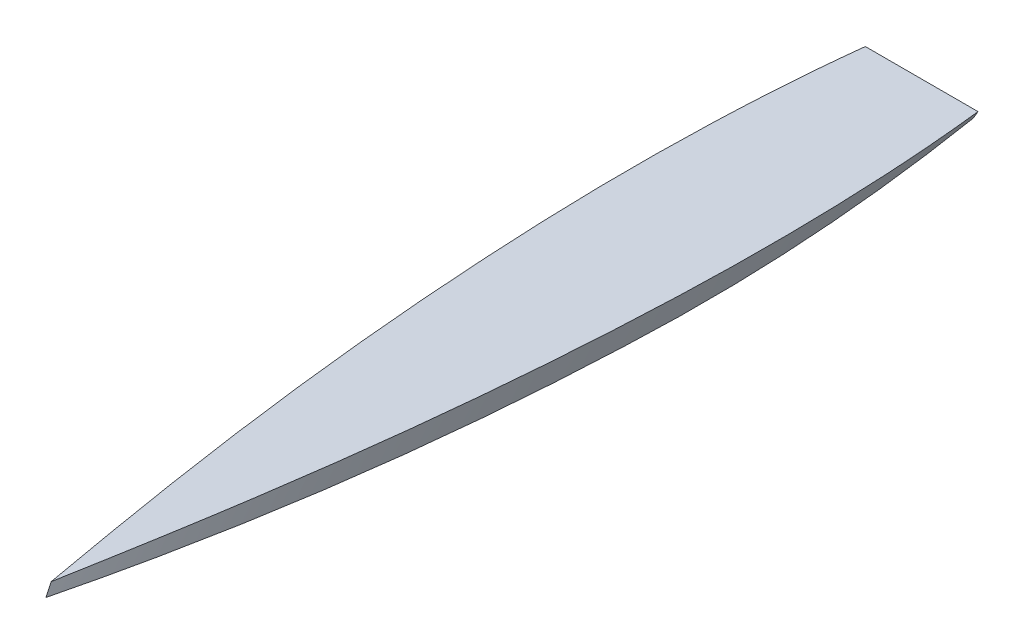
ISO-10303-21;
HEADER;
FILE_DESCRIPTION(('STEP AP214'),'2;1');
FILE_NAME('part.step','',(''),(''),'','','');
FILE_SCHEMA(('AUTOMOTIVE_DESIGN { 1 0 10303 214 1 1 1 1 }'));
ENDSEC;
DATA;
#1=APPLICATION_CONTEXT('core data for automotive mechanical design processes');
#2=APPLICATION_PROTOCOL_DEFINITION('international standard','automotive_design',2000,#1);
#3=PRODUCT_CONTEXT('',#1,'mechanical');
#4=PRODUCT('Part','Part','',(#3));
#5=PRODUCT_RELATED_PRODUCT_CATEGORY('part','',(#4));
#6=PRODUCT_DEFINITION_FORMATION('','',#4);
#7=PRODUCT_DEFINITION_CONTEXT('part definition',#1,'design');
#8=PRODUCT_DEFINITION('design','',#6,#7);
#9=PRODUCT_DEFINITION_SHAPE('','',#8);
#10=(LENGTH_UNIT() NAMED_UNIT(*) SI_UNIT(.MILLI.,.METRE.));
#11=(NAMED_UNIT(*) PLANE_ANGLE_UNIT() SI_UNIT($,.RADIAN.));
#12=(NAMED_UNIT(*) SI_UNIT($,.STERADIAN.) SOLID_ANGLE_UNIT());
#13=UNCERTAINTY_MEASURE_WITH_UNIT(LENGTH_MEASURE(1.E-05),#10,'distance_accuracy_value','');
#14=(GEOMETRIC_REPRESENTATION_CONTEXT(3) GLOBAL_UNCERTAINTY_ASSIGNED_CONTEXT((#13)) GLOBAL_UNIT_ASSIGNED_CONTEXT((#10,
#11,#12)) REPRESENTATION_CONTEXT('',''));
#15=CARTESIAN_POINT('',(0.,0.,0.));
#16=DIRECTION('',(0.,0.,1.));
#17=DIRECTION('',(1.,0.,0.));
#18=AXIS2_PLACEMENT_3D('',#15,#16,#17);
#19=CARTESIAN_POINT('',(0.,50.,0.));
#20=DIRECTION('',(0.,1.,0.));
#21=DIRECTION('',(0.,0.,1.));
#22=AXIS2_PLACEMENT_3D('',#19,#20,#21);
#23=PLANE('',#22);
#24=DIRECTION('',(-1.,0.,0.));
#25=VECTOR('',#24,1.);
#26=CARTESIAN_POINT('',(0.,50.,-5500.));
#27=LINE('',#26,#25);
#28=CARTESIAN_POINT('',(353.846153846155,50.,-5500.));
#29=VERTEX_POINT('',#28);
#30=CARTESIAN_POINT('',(-353.846153846155,50.,-5500.));
#31=VERTEX_POINT('',#30);
#32=EDGE_CURVE('E127',#29,#31,#27,.T.);
#33=ORIENTED_EDGE('',*,*,#32,.T.);
#34=CARTESIAN_POINT('',(-353.846153846155,50.,-5500.));
#35=CARTESIAN_POINT('',(-355.494475382305,50.,-5485.73603092094));
#36=CARTESIAN_POINT('',(-357.107757859096,50.,-5471.46802501439));
#37=CARTESIAN_POINT('',(-360.266483073462,50.,-5442.92458720515));
#38=CARTESIAN_POINT('',(-361.811926201855,50.,-5428.64915534572));
#39=CARTESIAN_POINT('',(-364.837227775977,50.,-5400.09137029185));
#40=CARTESIAN_POINT('',(-366.317086319926,50.,-5385.80901710781));
#41=CARTESIAN_POINT('',(-369.212949780399,50.,-5357.24028510158));
#42=CARTESIAN_POINT('',(-370.628965469393,50.,-5342.95390737094));
#43=CARTESIAN_POINT('',(-373.399216294718,50.,-5314.37514511127));
#44=CARTESIAN_POINT('',(-374.753451341881,50.,-5300.08276057361));
#45=CARTESIAN_POINT('',(-377.401774264953,50.,-5271.492416347));
#46=CARTESIAN_POINT('',(-378.695862116136,50.,-5257.19445665575));
#47=CARTESIAN_POINT('',(-381.22527594233,50.,-5228.59452597008));
#48=CARTESIAN_POINT('',(-382.460606734643,50.,-5214.29255540154));
#49=CARTESIAN_POINT('',(-384.8739777462,50.,-5185.6837916399));
#50=CARTESIAN_POINT('',(-386.052017999292,50.,-5171.37699844966));
#51=CARTESIAN_POINT('',(-388.352050559336,50.,-5142.75891118696));
#52=CARTESIAN_POINT('',(-389.47404287446,50.,-5128.44761711514));
#53=CARTESIAN_POINT('',(-391.663085977972,50.,-5099.82123850941));
#54=CARTESIAN_POINT('',(-392.730138328043,50.,-5085.50615409488));
#55=CARTESIAN_POINT('',(-394.810380105171,50.,-5056.87207269894));
#56=CARTESIAN_POINT('',(-395.823569529367,50.,-5042.55307571732));
#57=CARTESIAN_POINT('',(-397.797042803667,50.,-5013.91143728101));
#58=CARTESIAN_POINT('',(-398.75732665283,50.,-4999.58879582625));
#59=CARTESIAN_POINT('',(-400.625883192003,50.,-4970.94011030944));
#60=CARTESIAN_POINT('',(-401.534155840159,50.,-4956.61406624466));
#61=CARTESIAN_POINT('',(-403.29952890201,50.,-4927.95882701317));
#62=CARTESIAN_POINT('',(-404.156629320536,50.,-4913.62963184676));
#63=CARTESIAN_POINT('',(-405.820431233438,50.,-4884.96832027813));
#64=CARTESIAN_POINT('',(-406.627132729131,50.,-4870.63620387598));
#65=CARTESIAN_POINT('',(-408.580700480576,50.,-4834.82252992145));
#66=CARTESIAN_POINT('',(-409.696623728737,50.,-4813.33927760853));
#67=CARTESIAN_POINT('',(-411.819120026891,50.,-4770.36738321299));
#68=CARTESIAN_POINT('',(-412.825693076396,50.,-4748.87874113035));
#69=CARTESIAN_POINT('',(-414.731501431729,50.,-4705.89602867817));
#70=CARTESIAN_POINT('',(-415.630733397584,50.,-4684.40195816058));
#71=CARTESIAN_POINT('',(-417.323613255518,50.,-4641.40966442522));
#72=CARTESIAN_POINT('',(-418.11726114912,50.,-4619.91144120752));
#73=CARTESIAN_POINT('',(-419.600614534489,50.,-4576.91087695005));
#74=CARTESIAN_POINT('',(-420.290317464621,50.,-4555.40853582187));
#75=CARTESIAN_POINT('',(-421.567224186407,50.,-4512.40080235399));
#76=CARTESIAN_POINT('',(-422.154427854779,50.,-4490.89541001066));
#77=CARTESIAN_POINT('',(-423.764363073529,50.,-4426.3750528871));
#78=CARTESIAN_POINT('',(-424.635408146755,50.,-4383.3562191135));
#79=CARTESIAN_POINT('',(-425.982603893335,50.,-4297.31286031856));
#80=CARTESIAN_POINT('',(-426.458758836103,50.,-4254.28833536378));
#81=CARTESIAN_POINT('',(-426.859267068212,50.,-4193.34854783468));
#82=CARTESIAN_POINT('',(-426.943478523649,50.,-4175.43421911285));
#83=CARTESIAN_POINT('',(-427.045374851772,50.,-4139.60534754906));
#84=CARTESIAN_POINT('',(-427.063059677615,50.,-4121.69080470695));
#85=CARTESIAN_POINT('',(-427.032408198666,50.,-4085.86177637969));
#86=CARTESIAN_POINT('',(-426.984071882108,50.,-4067.94729089454));
#87=CARTESIAN_POINT('',(-426.82185379543,50.,-4032.11902424088));
#88=CARTESIAN_POINT('',(-426.707973517774,50.,-4014.20524306563));
#89=CARTESIAN_POINT('',(-426.415126833831,50.,-3978.3782174236));
#90=CARTESIAN_POINT('',(-426.236160441798,50.,-3960.46497295671));
#91=CARTESIAN_POINT('',(-425.813593250575,50.,-3924.63924817297));
#92=CARTESIAN_POINT('',(-425.569992455856,50.,-3906.72676785607));
#93=CARTESIAN_POINT('',(-425.018588001412,50.,-3870.90291976826));
#94=CARTESIAN_POINT('',(-424.710784786479,50.,-3852.9915519905));
#95=CARTESIAN_POINT('',(-424.031387508986,50.,-3817.17002671723));
#96=CARTESIAN_POINT('',(-423.659793442158,50.,-3799.2598692218));
#97=CARTESIAN_POINT('',(-422.853212017789,50.,-3763.44097569306));
#98=CARTESIAN_POINT('',(-422.418224652302,50.,-3745.53223965994));
#99=CARTESIAN_POINT('',(-421.718486621486,50.,-3718.67035588195));
#100=CARTESIAN_POINT('',(-421.477364107681,50.,-3709.71658651115));
#101=CARTESIAN_POINT('',(-420.979413568863,50.,-3691.80948361767));
#102=CARTESIAN_POINT('',(-420.722585544148,50.,-3682.85615009498));
#103=CARTESIAN_POINT('',(-420.193270436888,50.,-3664.94994856931));
#104=CARTESIAN_POINT('',(-419.920783358452,50.,-3655.99708056621));
#105=CARTESIAN_POINT('',(-419.360195762576,50.,-3638.0918330399));
#106=CARTESIAN_POINT('',(-419.072095244367,50.,-3629.13945351673));
#107=CARTESIAN_POINT('',(-418.480326153211,50.,-3611.23521558348));
#108=CARTESIAN_POINT('',(-418.17665759248,50.,-3602.283357173));
#109=CARTESIAN_POINT('',(-417.709512102259,50.,-3588.85597616638));
#110=CARTESIAN_POINT('',(-417.551856498889,50.,-3584.38025030835));
#111=CARTESIAN_POINT('',(-417.232669916953,50.,-3575.42893658339));
#112=CARTESIAN_POINT('',(-417.071138938331,50.,-3570.95334871646));
#113=CARTESIAN_POINT('',(-416.744170092243,50.,-3562.00130032576));
#114=CARTESIAN_POINT('',(-416.578731347854,50.,-3557.52483983402));
#115=CARTESIAN_POINT('',(-416.243987736396,50.,-3548.57206347246));
#116=CARTESIAN_POINT('',(-416.074682869449,50.,-3544.09574760265));
#117=CARTESIAN_POINT('',(-415.817830094529,50.,-3537.38138446422));
#118=CARTESIAN_POINT('',(-415.731729918329,50.,-3535.14328172243));
#119=CARTESIAN_POINT('',(-415.558565050202,50.,-3530.6671135586));
#120=CARTESIAN_POINT('',(-415.471500358285,50.,-3528.42904813655));
#121=CARTESIAN_POINT('',(-415.296407297503,50.,-3523.95295491675));
#122=CARTESIAN_POINT('',(-415.20837892861,50.,-3521.71492711901));
#123=CARTESIAN_POINT('',(-415.031358587484,50.,-3517.23890963845));
#124=CARTESIAN_POINT('',(-414.942366615242,50.,-3515.00091995564));
#125=CARTESIAN_POINT('',(-414.674294705667,50.,-3508.28699106837));
#126=CARTESIAN_POINT('',(-414.494118914982,50.,-3503.81109557687));
#127=CARTESIAN_POINT('',(-414.13074288371,50.,-3494.85942743317));
#128=CARTESIAN_POINT('',(-413.947542643154,50.,-3490.38365478097));
#129=CARTESIAN_POINT('',(-413.578147052476,50.,-3481.43223306354));
#130=CARTESIAN_POINT('',(-413.391951702361,50.,-3476.95658399831));
#131=CARTESIAN_POINT('',(-413.016560076104,50.,-3468.00541181381));
#132=CARTESIAN_POINT('',(-412.827363799973,50.,-3463.52988869453));
#133=CARTESIAN_POINT('',(-412.255278479207,50.,-3450.1035060567));
#134=CARTESIAN_POINT('',(-411.867893124765,50.,-3441.15283768219));
#135=CARTESIAN_POINT('',(-411.081143841873,50.,-3423.25202807181));
#136=CARTESIAN_POINT('',(-410.681779913841,50.,-3414.30188683593));
#137=CARTESIAN_POINT('',(-409.871082348101,50.,-3396.40204305069));
#138=CARTESIAN_POINT('',(-409.459748572722,50.,-3387.45234050757));
#139=CARTESIAN_POINT('',(-408.625129097153,50.,-3369.55349320536));
#140=CARTESIAN_POINT('',(-408.201843396731,50.,-3360.60434844627));
#141=CARTESIAN_POINT('',(-406.914079916323,50.,-3333.75779463843));
#142=CARTESIAN_POINT('',(-406.031694628215,50.,-3315.86124113337));
#143=CARTESIAN_POINT('',(-404.219284299551,50.,-3280.07055543011));
#144=CARTESIAN_POINT('',(-403.289259275703,50.,-3262.17642323108));
#145=CARTESIAN_POINT('',(-401.381679734732,50.,-3226.3905662266));
#146=CARTESIAN_POINT('',(-400.404124884909,50.,-3208.49884143889));
#147=CARTESIAN_POINT('',(-398.401613140832,50.,-3172.7180359244));
#148=CARTESIAN_POINT('',(-397.376656222463,50.,-3154.82895519898));
#149=CARTESIAN_POINT('',(-395.2794671867,50.,-3119.05356026288));
#150=CARTESIAN_POINT('',(-394.207235056511,50.,-3101.16724605294));
#151=CARTESIAN_POINT('',(-392.015628086499,50.,-3065.39751690924));
#152=CARTESIAN_POINT('',(-390.896253274773,50.,-3047.51410197376));
#153=CARTESIAN_POINT('',(-388.610498744776,50.,-3011.75028207262));
#154=CARTESIAN_POINT('',(-387.444119041541,50.,-2993.869877106));
#155=CARTESIAN_POINT('',(-385.064498611438,50.,-2958.11219696002));
#156=CARTESIAN_POINT('',(-383.851257912769,50.,-2940.23492177879));
#157=CARTESIAN_POINT('',(-381.378724681719,50.,-2904.49315773869));
#158=CARTESIAN_POINT('',(-380.119457114337,50.,-2886.62866715338));
#159=CARTESIAN_POINT('',(-377.554414806447,50.,-2850.90303571255));
#160=CARTESIAN_POINT('',(-376.248640081118,50.,-2833.04189485594));
#161=CARTESIAN_POINT('',(-372.261818953333,50.,-2779.46399599387));
#162=CARTESIAN_POINT('',(-369.511249584799,50.,-2743.75238573784));
#163=CARTESIAN_POINT('',(-363.826096793675,50.,-2672.34405923576));
#164=CARTESIAN_POINT('',(-360.891514511293,50.,-2636.6473428988));
#165=CARTESIAN_POINT('',(-354.839803984173,50.,-2565.26949686994));
#166=CARTESIAN_POINT('',(-351.722676309203,50.,-2529.58836712973));
#167=CARTESIAN_POINT('',(-345.307472584919,50.,-2458.24240631439));
#168=CARTESIAN_POINT('',(-342.009396657844,50.,-2422.57757522826));
#169=CARTESIAN_POINT('',(-335.23403219837,50.,-2351.26490390888));
#170=CARTESIAN_POINT('',(-331.75674347394,50.,-2315.61706369387));
#171=CARTESIAN_POINT('',(-324.625087785852,50.,-2244.34161325011));
#172=CARTESIAN_POINT('',(-320.970733180418,50.,-2208.71400178458));
#173=CARTESIAN_POINT('',(-313.486798661448,50.,-2137.47706863252));
#174=CARTESIAN_POINT('',(-309.657218152377,50.,-2101.86774700856));
#175=CARTESIAN_POINT('',(-301.825183292883,50.,-2030.66804854774));
#176=CARTESIAN_POINT('',(-297.822728581522,50.,-1995.07767175058));
#177=CARTESIAN_POINT('',(-289.647489459514,50.,-1923.9164964078));
#178=CARTESIAN_POINT('',(-285.474705075196,50.,-1888.34569785914));
#179=CARTESIAN_POINT('',(-276.961580459458,50.,-1817.22428323685));
#180=CARTESIAN_POINT('',(-272.621240802911,50.0000000000001,-1781.67366709441));
#181=CARTESIAN_POINT('',(-263.776047596488,49.9999999999999,-1710.59320217858));
#182=CARTESIAN_POINT('',(-259.271195339251,49.9999999999995,-1675.06335324426));
#183=CARTESIAN_POINT('',(-248.89835181705,49.9999999999994,-1594.71450807813));
#184=CARTESIAN_POINT('',(-242.98255727467,49.9999999999998,-1549.90167682818));
#185=CARTESIAN_POINT('',(-230.901479743162,50.0000000000002,-1460.30976567275));
#186=CARTESIAN_POINT('',(-224.736197200323,50.,-1415.53068570704));
#187=CARTESIAN_POINT('',(-212.164374155111,50.,-1326.00607215459));
#188=CARTESIAN_POINT('',(-205.757831833955,50.,-1281.26053882335));
#189=CARTESIAN_POINT('',(-192.712661906579,50.,-1191.80270444251));
#190=CARTESIAN_POINT('',(-186.074031079608,50.,-1147.09040386289));
#191=CARTESIAN_POINT('',(-172.575076714923,50.,-1057.69851008236));
#192=CARTESIAN_POINT('',(-165.714749442695,50.,-1013.01891744539));
#193=CARTESIAN_POINT('',(-155.266999661235,50.,-946.023738163458));
#194=CARTESIAN_POINT('',(-151.75817677275,50.,-923.695861212409));
#195=CARTESIAN_POINT('',(-144.689799715734,50.,-879.048134614898));
#196=CARTESIAN_POINT('',(-141.130245547227,50.,-856.728284968432));
#197=CARTESIAN_POINT('',(-133.962405660808,50.,-812.097678217767));
#198=CARTESIAN_POINT('',(-130.354122642851,50.,-789.786920679788));
#199=CARTESIAN_POINT('',(-123.090564467909,50.,-745.173050726721));
#200=CARTESIAN_POINT('',(-119.43528929723,50.,-722.869938313863));
#201=CARTESIAN_POINT('',(-112.079823103553,50.,-678.271153211678));
#202=CARTESIAN_POINT('',(-108.379632140153,50.,-655.975480512519));
#203=CARTESIAN_POINT('',(-100.936552111352,50.,-611.391269461622));
#204=CARTESIAN_POINT('',(-97.1936630546512,50.,-589.102731108433));
#205=CARTESIAN_POINT('',(-89.6676243903792,50.,-544.532765368542));
#206=CARTESIAN_POINT('',(-85.8844753299114,50.,-522.251337889438));
#207=CARTESIAN_POINT('',(-78.2804330187357,50.,-477.694925681615));
#208=CARTESIAN_POINT('',(-74.4595397676119,50.,-455.419940952967));
#209=CARTESIAN_POINT('',(-66.7828983517902,50.,-410.876684327875));
#210=CARTESIAN_POINT('',(-62.9271512611775,50.,-388.608412246274));
#211=CARTESIAN_POINT('',(-55.1836786382871,50.,-344.077428620562));
#212=CARTESIAN_POINT('',(-51.2959531036225,50.,-321.814717076868));
#213=CARTESIAN_POINT('',(-43.4919572523499,50.,-277.295507467986));
#214=CARTESIAN_POINT('',(-39.5756884496975,50.,-255.039009137332));
#215=CARTESIAN_POINT('',(-31.7178917571624,50.,-210.530470345935));
#216=CARTESIAN_POINT('',(-27.776363863997,50.,-188.278429885772));
#217=CARTESIAN_POINT('',(-19.8721352774953,50.,-143.779929760537));
#218=CARTESIAN_POINT('',(-15.9094362866877,50.,-121.533469792959));
#219=CARTESIAN_POINT('',(-9.95234912421997,50.,-88.1661138481035));
#220=CARTESIAN_POINT('',(-7.96448070766469,50.,-77.0440531926717));
#221=CARTESIAN_POINT('',(-3.98494882259596,50.,-54.8006112956592));
#222=CARTESIAN_POINT('',(-1.99328535424146,50.,-43.6792300540502));
#223=CARTESIAN_POINT('',(-2.34437250116722E-12,50.,-32.5581395348867));
#224=B_SPLINE_CURVE_WITH_KNOTS('',3,(#34,#35,#36,#37,#38,#39,#40,#41,#42,#43,#44,#45,#46,#47,
#48,#49,#50,#51,#52,#53,#54,#55,#56,#57,#58,#59,#60,#61,#62,#63,#64,#65,#66,#67,#68,#69,#70,#71,
#72,#73,#74,#75,#76,#77,#78,#79,#80,#81,#82,#83,#84,#85,#86,#87,#88,#89,#90,#91,#92,#93,#94,#95,
#96,#97,#98,#99,#100,#101,#102,#103,#104,#105,#106,#107,#108,#109,#110,#111,#112,#113,#114,#115,
#116,#117,#118,#119,#120,#121,#122,#123,#124,#125,#126,#127,#128,#129,#130,#131,#132,#133,#134,
#135,#136,#137,#138,#139,#140,#141,#142,#143,#144,#145,#146,#147,#148,#149,#150,#151,#152,#153,
#154,#155,#156,#157,#158,#159,#160,#161,#162,#163,#164,#165,#166,#167,#168,#169,#170,#171,#172,
#173,#174,#175,#176,#177,#178,#179,#180,#181,#182,#183,#184,#185,#186,#187,#188,#189,#190,#191,
#192,#193,#194,#195,#196,#197,#198,#199,#200,#201,#202,#203,#204,#205,#206,#207,#208,#209,#210,
#211,#212,#213,#214,#215,#216,#217,#218,#219,#220,#221,#222,#223),.UNSPECIFIED.,.F.,.F.,(4,2,2,
2,2,2,2,2,2,2,2,2,2,2,2,2,2,2,2,2,2,2,2,2,2,2,2,2,2,2,2,2,2,2,2,2,2,2,2,2,2,2,2,2,2,2,2,2,2,2,2,
2,2,2,2,2,2,2,2,2,2,2,2,2,2,2,2,2,2,2,2,2,2,2,2,2,2,2,2,2,2,2,2,2,2,2,2,2,2,2,2,2,2,2,4),(0.,
43.0766146796021,86.1529811643307,129.229283135277,172.298289250999,215.367357525967,
258.436443505238,301.501992279343,344.567515608555,387.633032658474,430.697324883486,
473.761619395636,516.82591467356,559.890244604945,602.954570469353,646.018895208858,
710.555239186526,775.091583452308,839.629935276771,904.168286170304,968.708227296789,
1033.24824604813,1162.32921736431,1291.40879308368,1345.15227917768,1398.89580311324,
1452.63933662639,1506.38164642413,1560.12394445197,1613.8662387637,1667.60816076441,
1721.35008636038,1775.09201869204,1801.96305382813,1828.83408845751,1855.70511603805,
1882.57614494269,1909.44715276068,1922.88265641355,1936.31816025753,1949.7567082941,
1963.19525591138,1969.9145305608,1976.63380514856,1983.35307994069,1990.07235480734,
2003.51091520422,2016.94947546198,2030.38803569114,2043.82659587241,2070.70372951826,
2097.58086222589,2124.45830418192,2151.3357466576,2205.09055675535,2258.8453479989,
2312.60051556876,2366.35571048527,2420.11091994972,2473.86609737545,2527.62125760489,
2581.37638548826,2635.10277707408,2688.82915112362,2796.28076866451,2903.73172046443,
3011.18233690273,3118.63288075365,3226.08353974232,3333.52671003762,3440.97024552322,
3548.41400534815,3655.85774856485,3763.30112318123,3870.74365375523,4006.34776257128,
4141.95162882586,4277.55651756069,4413.16328886663,4548.77234568309,4616.5780011842,
4684.38365665406,4752.18557045586,4819.98750401575,4887.78934762131,4955.59117741249,
5023.39208700082,5091.19299733597,5158.99182533627,5226.79065839688,5294.58592115582,
5362.38119272557,5430.17109205143,5464.06602754119,5497.96096161147),.UNSPECIFIED.);
#225=CARTESIAN_POINT('',(2.34437250116722E-12,50.,-32.5581395348867));
#226=VERTEX_POINT('',#225);
#227=EDGE_CURVE('E114',#31,#226,#224,.T.);
#228=ORIENTED_EDGE('',*,*,#227,.T.);
#229=CARTESIAN_POINT('',(2.34437250116722E-12,50.,-32.5581395348867));
#230=CARTESIAN_POINT('',(3.15762921726244,50.,-50.175311569445));
#231=CARTESIAN_POINT('',(6.31115577420077,50.,-67.79322020741));
#232=CARTESIAN_POINT('',(12.6078890968515,50.,-103.030885278235));
#233=CARTESIAN_POINT('',(15.7510958603327,50.,-120.650641711493));
#234=CARTESIAN_POINT('',(22.0252022994735,50.,-155.893091375681));
#235=CARTESIAN_POINT('',(25.1561014655609,50.,-173.515784697365));
#236=CARTESIAN_POINT('',(31.4035213316545,50.,-208.763718293315));
#237=CARTESIAN_POINT('',(34.5200420325394,50.,-226.388958567426));
#238=CARTESIAN_POINT('',(43.84541749248,50.,-279.269943116714));
#239=CARTESIAN_POINT('',(50.0299140715689,50.,-314.529988761213));
#240=CARTESIAN_POINT('',(62.3206307306313,50.,-385.064310719516));
#241=CARTESIAN_POINT('',(68.4268495530496,50.,-420.338587252576));
#242=CARTESIAN_POINT('',(80.5491178093143,50.,-490.902899161074));
#243=CARTESIAN_POINT('',(86.5651666014146,50.,-526.192934646829));
#244=CARTESIAN_POINT('',(98.4965613420593,50.,-596.790053357508));
#245=CARTESIAN_POINT('',(104.411907238551,50.,-632.097136591235));
#246=CARTESIAN_POINT('',(116.133022114844,50.,-702.732381880981));
#247=CARTESIAN_POINT('',(121.938782341492,50.,-738.060545390233));
#248=CARTESIAN_POINT('',(133.431852660668,50.,-808.73584717323));
#249=CARTESIAN_POINT('',(139.119163720548,50.,-844.082985289594));
#250=CARTESIAN_POINT('',(150.367842581481,50.,-914.796996090043));
#251=CARTESIAN_POINT('',(155.929211452414,50.,-950.163868603867));
#252=CARTESIAN_POINT('',(166.919412087268,50.,-1020.91796829998));
#253=CARTESIAN_POINT('',(172.348244729302,50.,-1056.30519534582));
#254=CARTESIAN_POINT('',(183.067499865257,50.,-1127.10051280058));
#255=CARTESIAN_POINT('',(188.357922744992,50.,-1162.50860315107));
#256=CARTESIAN_POINT('',(198.795067182344,50.,-1233.34606573015));
#257=CARTESIAN_POINT('',(203.941788334163,50.,-1268.77543801856));
#258=CARTESIAN_POINT('',(214.08811517719,50.,-1339.66517401461));
#259=CARTESIAN_POINT('',(219.087680093089,50.,-1375.12554356012));
#260=CARTESIAN_POINT('',(228.933858196497,50.,-1446.0677772142));
#261=CARTESIAN_POINT('',(233.780470283268,50.,-1481.54964147558));
#262=CARTESIAN_POINT('',(243.316693872696,50.,-1552.53460275384));
#263=CARTESIAN_POINT('',(248.006304786803,50.,-1588.03769984982));
#264=CARTESIAN_POINT('',(257.224847623113,50.,-1659.06481697703));
#265=CARTESIAN_POINT('',(261.753779263533,50.,-1694.58883704484));
#266=CARTESIAN_POINT('',(270.647601878245,50.,-1765.65744931221));
#267=CARTESIAN_POINT('',(275.012492677383,50.,-1801.20204153369));
#268=CARTESIAN_POINT('',(283.575175710874,50.,-1872.31140797627));
#269=CARTESIAN_POINT('',(287.772967684773,50.,-1907.87618222872));
#270=CARTESIAN_POINT('',(295.99888362918,50.,-1979.02739258416));
#271=CARTESIAN_POINT('',(300.026997975328,50.,-2014.61382980007));
#272=CARTESIAN_POINT('',(307.910740624439,50.,-2085.80582903958));
#273=CARTESIAN_POINT('',(311.766368831882,50.,-2121.41139107376));
#274=CARTESIAN_POINT('',(319.302756861627,50.,-2192.64098257041));
#275=CARTESIAN_POINT('',(322.983516868284,50.,-2228.26501201338));
#276=CARTESIAN_POINT('',(330.168033449513,50.,-2299.53085584916));
#277=CARTESIAN_POINT('',(333.671790331378,50.,-2335.172670211));
#278=CARTESIAN_POINT('',(340.500398384058,50.,-2406.47337815777));
#279=CARTESIAN_POINT('',(343.825249842478,50.,-2442.13227171515));
#280=CARTESIAN_POINT('',(350.294287383963,50.,-2513.46641821706));
#281=CARTESIAN_POINT('',(353.438473604377,50.,-2549.14167114913));
#282=CARTESIAN_POINT('',(359.545358841006,50.,-2620.51710071565));
#283=CARTESIAN_POINT('',(362.508010213753,50.,-2656.21728142706));
#284=CARTESIAN_POINT('',(368.249441516029,50.,-2727.63247623619));
#285=CARTESIAN_POINT('',(371.028221203527,50.,-2763.34749035338));
#286=CARTESIAN_POINT('',(376.400531686415,50.,-2834.79149725781));
#287=CARTESIAN_POINT('',(378.994062215403,50.,-2870.52049006508));
#288=CARTESIAN_POINT('',(383.994600553599,50.,-2941.99162340083));
#289=CARTESIAN_POINT('',(386.401607966949,50.,-2977.73376395706));
#290=CARTESIAN_POINT('',(389.871338722298,50.,-3031.35610702822));
#291=CARTESIAN_POINT('',(391.0044544753,50.,-3049.2317809218));
#292=CARTESIAN_POINT('',(393.223620205425,50.,-3084.98605434425));
#293=CARTESIAN_POINT('',(394.309670183682,50.,-3102.86465387305));
#294=CARTESIAN_POINT('',(396.434575651353,50.,-3138.6247450469));
#295=CARTESIAN_POINT('',(397.473430906889,50.,-3156.50623670584));
#296=CARTESIAN_POINT('',(399.503813538335,50.,-3192.27190846381));
#297=CARTESIAN_POINT('',(400.495340910852,50.,-3210.15608856303));
#298=CARTESIAN_POINT('',(402.430729649201,50.,-3245.92304682403));
#299=CARTESIAN_POINT('',(403.374601545868,50.,-3263.80582441593));
#300=CARTESIAN_POINT('',(405.214796434553,50.,-3299.57382178122));
#301=CARTESIAN_POINT('',(406.111119436051,50.,-3317.45904155412));
#302=CARTESIAN_POINT('',(407.856104223312,50.,-3353.23183138719));
#303=CARTESIAN_POINT('',(408.704765948419,50.,-3371.11940145031));
#304=CARTESIAN_POINT('',(409.941928546256,50.,-3397.95240799855));
#305=CARTESIAN_POINT('',(410.34834455172,50.,-3406.89702193032));
#306=CARTESIAN_POINT('',(411.149221420251,50.,-3424.78678564598));
#307=CARTESIAN_POINT('',(411.543682283314,50.,-3433.73193542988));
#308=CARTESIAN_POINT('',(412.320629300004,50.,-3451.62274033364));
#309=CARTESIAN_POINT('',(412.703115472906,50.,-3460.56839545267));
#310=CARTESIAN_POINT('',(413.456122820706,50.,-3478.46020926467));
#311=CARTESIAN_POINT('',(413.826643996156,50.,-3487.40636795762));
#312=CARTESIAN_POINT('',(414.373381316761,50.,-3500.82597207509));
#313=CARTESIAN_POINT('',(414.554119655106,50.,-3505.29923374734));
#314=CARTESIAN_POINT('',(414.912683972272,50.,-3514.2458736465));
#315=CARTESIAN_POINT('',(415.090509951344,50.,-3518.71925187339));
#316=CARTESIAN_POINT('',(415.442249276777,50.,-3527.66616172755));
#317=CARTESIAN_POINT('',(415.616162623629,50.,-3532.13969335479));
#318=CARTESIAN_POINT('',(415.96015128368,50.,-3541.0869042307));
#319=CARTESIAN_POINT('',(416.130226596776,50.,-3545.56058347937));
#320=CARTESIAN_POINT('',(416.466512175318,50.,-3554.50808377805));
#321=CARTESIAN_POINT('',(416.632722443799,50.,-3558.98190482795));
#322=CARTESIAN_POINT('',(416.961278295663,50.,-3567.92968869283));
#323=CARTESIAN_POINT('',(417.123623879054,50.,-3572.4036515078));
#324=CARTESIAN_POINT('',(417.604853307093,50.,-3585.82574937309));
#325=CARTESIAN_POINT('',(417.917929811773,50.,-3594.7740933692));
#326=CARTESIAN_POINT('',(418.52855338414,50.,-3612.67131367694));
#327=CARTESIAN_POINT('',(418.826100446714,50.,-3621.62018998873));
#328=CARTESIAN_POINT('',(419.405619936156,50.,-3639.51844646819));
#329=CARTESIAN_POINT('',(419.687592363922,50.,-3648.46782663581));
#330=CARTESIAN_POINT('',(420.235921247563,50.,-3666.36719197105));
#331=CARTESIAN_POINT('',(420.502277483129,50.,-3675.31717714542));
#332=CARTESIAN_POINT('',(421.019323699046,50.,-3693.21759914792));
#333=CARTESIAN_POINT('',(421.270013679107,50.,-3702.16803597607));
#334=CARTESIAN_POINT('',(421.998514602596,50.,-3729.019982091));
#335=CARTESIAN_POINT('',(422.452756828711,50.,-3746.92213677803));
#336=CARTESIAN_POINT('',(423.298024693948,50.,-3782.72852599027));
#337=CARTESIAN_POINT('',(423.689048249094,50.,-3800.63276056458));
#338=CARTESIAN_POINT('',(424.407467478806,50.,-3836.442511167));
#339=CARTESIAN_POINT('',(424.734863129478,50.,-3854.34802719559));
#340=CARTESIAN_POINT('',(425.403482504325,50.,-3894.88020752782));
#341=CARTESIAN_POINT('',(425.725601842839,50.,-3917.50719079749));
#342=CARTESIAN_POINT('',(426.266734402304,50.,-3962.76237802318));
#343=CARTESIAN_POINT('',(426.485747578031,50.,-3985.39058197974));
#344=CARTESIAN_POINT('',(426.986789527366,50.,-4053.27799444141));
#345=CARTESIAN_POINT('',(427.112795280863,50.,-4098.53846849506));
#346=CARTESIAN_POINT('',(426.941101243967,50.,-4189.05898821712));
#347=CARTESIAN_POINT('',(426.643397268375,50.,-4234.31903387687));
#348=CARTESIAN_POINT('',(425.615470845591,50.,-4324.83380637538));
#349=CARTESIAN_POINT('',(424.885253601604,50.,-4370.08853327156));
#350=CARTESIAN_POINT('',(423.457760898632,50.,-4437.96287400543));
#351=CARTESIAN_POINT('',(422.926577227298,50.,-4460.58609114985));
#352=CARTESIAN_POINT('',(421.751988205831,50.,-4505.82960301297));
#353=CARTESIAN_POINT('',(421.108583016434,50.,-4528.44989773581));
#354=CARTESIAN_POINT('',(419.707975796114,50.,-4573.6861710701));
#355=CARTESIAN_POINT('',(418.950777726469,50.,-4596.30214980436));
#356=CARTESIAN_POINT('',(417.320806130604,50.,-4641.52995503892));
#357=CARTESIAN_POINT('',(416.448032603207,50.,-4664.14178153916));
#358=CARTESIAN_POINT('',(414.894664094544,50.,-4701.84360979544));
#359=CARTESIAN_POINT('',(414.246648854158,50.,-4716.93496138769));
#360=CARTESIAN_POINT('',(412.897609407284,50.,-4747.11529950924));
#361=CARTESIAN_POINT('',(412.196585200124,50.,-4762.20428603851));
#362=CARTESIAN_POINT('',(410.740847321052,50.,-4792.37966949369));
#363=CARTESIAN_POINT('',(409.986133647074,50.,-4807.46606641951));
#364=CARTESIAN_POINT('',(408.422289806289,50.,-4837.63590099923));
#365=CARTESIAN_POINT('',(407.613160142453,50.,-4852.71933867919));
#366=CARTESIAN_POINT('',(405.939686206632,50.,-4882.88315208237));
#367=CARTESIAN_POINT('',(405.075341933305,50.,-4897.9635278055));
#368=CARTESIAN_POINT('',(403.290582506035,50.,-4928.12096364566));
#369=CARTESIAN_POINT('',(402.370167346133,50.,-4943.19802376233));
#370=CARTESIAN_POINT('',(400.472328443093,50.,-4973.34872699316));
#371=CARTESIAN_POINT('',(399.494904059098,50.,-4988.42237006701));
#372=CARTESIAN_POINT('',(397.482049192692,50.,-5018.56578381733));
#373=CARTESIAN_POINT('',(396.446618711589,50.,-5033.6355544939));
#374=CARTESIAN_POINT('',(394.316682802388,50.,-5063.77092100935));
#375=CARTESIAN_POINT('',(393.22217737805,50.,-5078.8365168485));
#376=CARTESIAN_POINT('',(390.972869503654,50.,-5108.96396543664));
#377=CARTESIAN_POINT('',(389.818064042889,50.,-5124.02581796093));
#378=CARTESIAN_POINT('',(387.446930616318,50.,-5154.14468398999));
#379=CARTESIAN_POINT('',(386.230602640219,50.,-5169.20169749395));
#380=CARTESIAN_POINT('',(383.735025765797,50.,-5199.31052163964));
#381=CARTESIAN_POINT('',(382.455776824798,50.,-5214.36233227782));
#382=CARTESIAN_POINT('',(379.832670165448,50.,-5244.46210080114));
#383=CARTESIAN_POINT('',(378.488804900224,50.,-5259.51005802885));
#384=CARTESIAN_POINT('',(375.73491455263,50.,-5289.59991273114));
#385=CARTESIAN_POINT('',(374.324889501574,50.,-5304.64181020857));
#386=CARTESIAN_POINT('',(371.436817000445,50.,-5334.71905205912));
#387=CARTESIAN_POINT('',(369.958769662462,50.,-5349.75439644299));
#388=CARTESIAN_POINT('',(366.932250196545,50.,-5379.82139606358));
#389=CARTESIAN_POINT('',(365.383762381489,50.,-5394.85304972159));
#390=CARTESIAN_POINT('',(362.21438076002,50.,-5424.90875887942));
#391=CARTESIAN_POINT('',(360.59348683032,50.,-5439.93281436627));
#392=CARTESIAN_POINT('',(358.105930191423,50.,-5462.46272892305));
#393=CARTESIAN_POINT('',(357.267372220425,50.,-5469.97169947196));
#394=CARTESIAN_POINT('',(355.571167489193,50.,-5484.98748642828));
#395=CARTESIAN_POINT('',(354.713520723163,50.,-5492.49430283503));
#396=CARTESIAN_POINT('',(353.846153846155,49.9999999999999,-5500.));
#397=B_SPLINE_CURVE_WITH_KNOTS('',3,(#229,#230,#231,#232,#233,#234,#235,#236,#237,#238,#239,
#240,#241,#242,#243,#244,#245,#246,#247,#248,#249,#250,#251,#252,#253,#254,#255,#256,#257,#258,
#259,#260,#261,#262,#263,#264,#265,#266,#267,#268,#269,#270,#271,#272,#273,#274,#275,#276,#277,
#278,#279,#280,#281,#282,#283,#284,#285,#286,#287,#288,#289,#290,#291,#292,#293,#294,#295,#296,
#297,#298,#299,#300,#301,#302,#303,#304,#305,#306,#307,#308,#309,#310,#311,#312,#313,#314,#315,
#316,#317,#318,#319,#320,#321,#322,#323,#324,#325,#326,#327,#328,#329,#330,#331,#332,#333,#334,
#335,#336,#337,#338,#339,#340,#341,#342,#343,#344,#345,#346,#347,#348,#349,#350,#351,#352,#353,
#354,#355,#356,#357,#358,#359,#360,#361,#362,#363,#364,#365,#366,#367,#368,#369,#370,#371,#372,
#373,#374,#375,#376,#377,#378,#379,#380,#381,#382,#383,#384,#385,#386,#387,#388,#389,#390,#391,
#392,#393,#394,#395,#396),.UNSPECIFIED.,.F.,.F.,(4,2,2,2,2,2,2,2,2,2,2,2,2,2,2,2,2,2,2,2,2,2,2,
2,2,2,2,2,2,2,2,2,2,2,2,2,2,2,2,2,2,2,2,2,2,2,2,2,2,2,2,2,2,2,2,2,2,2,2,2,2,2,2,2,2,2,2,2,2,2,2,
2,2,2,2,2,2,2,2,2,2,2,2,4),(0.,53.6937472927452,107.387506193713,161.083465247963,
214.779421020855,322.174265140922,429.570832434004,536.968163713132,644.36555050374,
751.771479665051,859.176531318317,966.580670222527,1073.98409733109,1181.38722502346,
1288.79065597957,1396.22357226304,1503.65726152066,1611.09135347038,1718.52563381685,
1825.96002887276,1933.39459137919,2040.83523954569,2148.27594721014,2255.71654160161,
2363.15694945992,2470.59718459378,2578.03733804554,2685.50556923661,2792.97394188505,
2900.44246907782,3007.91122434518,3061.64582735543,3115.38042907143,3169.11529704362,
3222.85016886606,3276.57311399538,3330.29604841304,3384.01905119974,3410.88057165153,
3437.7420921117,3464.60356933151,3491.46504531044,3504.8957790171,3518.32651157531,
3531.75724245083,3545.18797369073,3558.6186943848,3572.04941505163,3598.91085780994,
3625.77230941152,3652.63375946404,3679.49558838107,3706.35741779239,3760.08104729214,
3813.80644740732,3867.53186769868,3935.4194414703,4003.30704501961,4139.08685770911,
4274.86801157453,4410.6475320041,4478.53566252493,4546.42369581025,4614.30936637261,
4682.19503762636,4727.5107274264,4772.82641780093,4818.14210991909,4863.45738323763,
4908.77265765825,4954.08793689538,4999.4037256322,5044.71951334707,5090.03529817678,
5135.35334773641,5180.6714048772,5225.98949275462,5271.312886483,5316.63625875907,
5361.95955635215,5407.29299735462,5452.62651555105,5475.29343858278,5497.96036849572),.UNSPECIFIED.);
#398=EDGE_CURVE('E126',#226,#29,#397,.T.);
#399=ORIENTED_EDGE('',*,*,#398,.T.);
#400=EDGE_LOOP('',(#33,#228,#399));
#401=FACE_BOUND('',#400,.T.);
#402=ADVANCED_FACE('F70',(#401),#23,.T.);
#403=CARTESIAN_POINT('',(0.,410.000000000004,-199.999999999997));
#404=CARTESIAN_POINT('',(-2.80022270972751E-12,-20.0000000000006,-4.27687308511412E-12));
#405=CARTESIAN_POINT('',(-40.6460138074899,415.605604798976,-336.030834817954));
#406=CARTESIAN_POINT('',(-23.4798094283868,-29.9227814208687,-144.537124229973));
#407=CARTESIAN_POINT('',(-117.914643849244,425.923770384332,-609.331638991227));
#408=CARTESIAN_POINT('',(-68.1067045738389,-48.5647798967173,-434.073155553304));
#409=CARTESIAN_POINT('',(-221.598125240044,438.636757432294,-1022.6494004414));
#410=CARTESIAN_POINT('',(-128.010443931738,-72.8809762651993,-869.609952148732));
#411=CARTESIAN_POINT('',(-312.955049997522,448.508997798755,-1438.96634636878));
#412=CARTESIAN_POINT('',(-180.839147703027,-93.514263040762,-1306.22689937484));
#413=CARTESIAN_POINT('',(-391.935109542685,455.473506574041,-1857.90192209429));
#414=CARTESIAN_POINT('',(-226.575034344596,-110.439224246861,-1743.76628854788));
#415=CARTESIAN_POINT('',(-458.432916593073,459.473274982426,-2279.08588508699));
#416=CARTESIAN_POINT('',(-265.200322313338,-123.630443906951,-2182.07041098411));
#417=CARTESIAN_POINT('',(-512.363493712748,460.460814694501,-2702.13943222422));
#418=CARTESIAN_POINT('',(-296.694530287246,-133.069681923384,-2620.98030368137));
#419=CARTESIAN_POINT('',(-553.712887102045,458.399948002518,-3126.67436204691));
#420=CARTESIAN_POINT('',(-321.037176944314,-138.73869819851,-3060.33700363749));
#421=CARTESIAN_POINT('',(-572.850011204851,454.975996500448,-3410.430088566));
#422=CARTESIAN_POINT('',(-332.498581512855,-140.000000000001,-3353.43185241634));
#423=CARTESIAN_POINT('',(-588.81165385947,450.205956552609,-3714.55056088362));
#424=CARTESIAN_POINT('',(-342.220210873797,-139.999999999995,-3667.34346815586));
#425=CARTESIAN_POINT('',(-600.315529420396,443.7754620669,-4039.19179474643));
#426=CARTESIAN_POINT('',(-349.473741747828,-134.152634486514,-4001.99738816503));
#427=CARTESIAN_POINT('',(-601.0372287013,430.08751355391,-4526.6442929118));
#428=CARTESIAN_POINT('',(-351.034809389984,-107.83221105002,-4503.18864098216));
#429=CARTESIAN_POINT('',(-585.178885977257,412.369694230101,-5013.89821084646));
#430=CARTESIAN_POINT('',(-343.344554410037,-64.0541799471897,-5002.90615735498));
#431=CARTESIAN_POINT('',(-563.554672842146,397.894006708683,-5338.1406669116));
#432=CARTESIAN_POINT('',(-332.11544500397,-23.2679275994491,-5334.61489461279));
#433=CARTESIAN_POINT('',(-549.999999999998,390.,-5500.));
#434=CARTESIAN_POINT('',(-324.999999999999,-3.5527136788005E-12,-5500.));
#435=B_SPLINE_SURFACE_WITH_KNOTS('',3,1,((#403,#404),(#405,#406),(#407,#408),(#409,#410),(#411,
#412),(#413,#414),(#415,#416),(#417,#418),(#419,#420),(#421,#422),(#423,#424),(#425,#426),(#427,
#428),(#429,#430),(#431,#432),(#433,#434)),.UNSPECIFIED.,.F.,.F.,.F.,(4,1,1,1,1,1,1,1,2,1,1,1,
4),(2,2),(0.,0.079573609557727,0.159147219115454,0.238720828673181,0.318294438230908,
0.397868047788635,0.477441657346362,0.557015266904089,0.636588876461816,0.727441657346362,
0.818294438230908,0.909147219115454,1.),(0.,1.),.UNSPECIFIED.);
#436=DIRECTION('',(0.499722453489572,-0.866185586048603,0.));
#437=VECTOR('',#436,1.);
#438=CARTESIAN_POINT('',(-437.499999999999,194.999999999998,-5500.));
#439=LINE('',#438,#437);
#440=CARTESIAN_POINT('',(-324.999999999999,-1.32532873564628E-12,-5500.));
#441=VERTEX_POINT('',#440);
#442=EDGE_CURVE('E93',#31,#441,#439,.T.);
#443=CARTESIAN_POINT('',(-324.999999999999,-3.5527136788005E-12,-5500.));
#444=CARTESIAN_POINT('',(-332.11544500397,-23.2679275994491,-5334.61489461279));
#445=CARTESIAN_POINT('',(-343.344554410037,-64.0541799471897,-5002.90615735498));
#446=CARTESIAN_POINT('',(-351.034809389984,-107.83221105002,-4503.18864098216));
#447=CARTESIAN_POINT('',(-349.473741747828,-134.152634486514,-4001.99738816503));
#448=CARTESIAN_POINT('',(-342.220210873797,-139.999999999995,-3667.34346815586));
#449=CARTESIAN_POINT('',(-332.498581512855,-140.000000000001,-3353.43185241634));
#450=CARTESIAN_POINT('',(-321.037176944314,-138.73869819851,-3060.33700363749));
#451=CARTESIAN_POINT('',(-296.694530287246,-133.069681923384,-2620.98030368137));
#452=CARTESIAN_POINT('',(-265.200322313338,-123.630443906951,-2182.07041098411));
#453=CARTESIAN_POINT('',(-226.575034344596,-110.439224246861,-1743.76628854788));
#454=CARTESIAN_POINT('',(-180.839147703027,-93.514263040762,-1306.22689937484));
#455=CARTESIAN_POINT('',(-128.010443931738,-72.8809762651993,-869.609952148732));
#456=CARTESIAN_POINT('',(-68.1067045738389,-48.5647798967173,-434.073155553304));
#457=CARTESIAN_POINT('',(-23.4798094283868,-29.9227814208687,-144.537124229973));
#458=CARTESIAN_POINT('',(-2.80022270972751E-12,-20.0000000000006,-4.27687308511412E-12));
#459=B_SPLINE_CURVE_WITH_KNOTS('',3,(#443,#444,#445,#446,#447,#448,#449,#450,#451,#452,#453,
#454,#455,#456,#457,#458),.UNSPECIFIED.,.F.,.F.,(4,1,1,1,2,1,1,1,1,1,1,1,4),(0.,
0.0908527808845461,0.181705561769092,0.272558342653638,0.363411123538184,0.442984733095911,
0.522558342653638,0.602131952211365,0.681705561769092,0.761279171326819,0.840852780884546,
0.920426390442273,1.),.UNSPECIFIED.);
#460=CARTESIAN_POINT('',(4.66703784954585E-13,-19.9999999999999,-2.37246504403981E-12));
#461=VERTEX_POINT('',#460);
#462=EDGE_CURVE('E84',#441,#461,#459,.T.);
#463=DIRECTION('',(0.,0.906721111888515,-0.421730749715568));
#464=VECTOR('',#463,1.);
#465=CARTESIAN_POINT('',(1.40011135486375E-12,195.000000000002,-100.));
#466=LINE('',#465,#464);
#467=EDGE_CURVE('E111',#461,#226,#466,.T.);
#468=ORIENTED_EDGE('',*,*,#227,.F.);
#469=ORIENTED_EDGE('',*,*,#442,.T.);
#470=ORIENTED_EDGE('',*,*,#462,.T.);
#471=ORIENTED_EDGE('',*,*,#467,.T.);
#472=EDGE_LOOP('',(#468,#469,#470,#471));
#473=FACE_BOUND('',#472,.T.);
#474=ADVANCED_FACE('F113',(#473),#435,.T.);
#475=CARTESIAN_POINT('',(0.,0.,-5500.));
#476=DIRECTION('',(0.,0.,1.));
#477=DIRECTION('',(1.,0.,0.));
#478=AXIS2_PLACEMENT_3D('',#475,#476,#477);
#479=PLANE('',#478);
#480=ORIENTED_EDGE('',*,*,#32,.F.);
#481=DIRECTION('',(-0.499722453489572,-0.866185586048603,0.));
#482=VECTOR('',#481,1.);
#483=CARTESIAN_POINT('',(437.499999999999,194.999999999998,-5500.));
#484=LINE('',#483,#482);
#485=CARTESIAN_POINT('',(324.999999999999,-1.32532873564628E-12,-5500.));
#486=VERTEX_POINT('',#485);
#487=EDGE_CURVE('E128',#29,#486,#484,.T.);
#488=ORIENTED_EDGE('',*,*,#487,.T.);
#489=DIRECTION('',(1.,0.,0.));
#490=VECTOR('',#489,1.);
#491=CARTESIAN_POINT('',(0.,5.32907051820075E-12,-5500.));
#492=LINE('',#491,#490);
#493=CARTESIAN_POINT('',(0.,3.10862446895044E-12,-5500.));
#494=VERTEX_POINT('',#493);
#495=EDGE_CURVE('E121',#494,#486,#492,.T.);
#496=ORIENTED_EDGE('',*,*,#495,.F.);
#497=DIRECTION('',(-1.,0.,0.));
#498=VECTOR('',#497,1.);
#499=CARTESIAN_POINT('',(0.,5.32907051820075E-12,-5500.));
#500=LINE('',#499,#498);
#501=EDGE_CURVE('E13',#494,#441,#500,.T.);
#502=ORIENTED_EDGE('',*,*,#501,.T.);
#503=ORIENTED_EDGE('',*,*,#442,.F.);
#504=EDGE_LOOP('',(#480,#488,#496,#502,#503));
#505=FACE_BOUND('',#504,.T.);
#506=ADVANCED_FACE('F149',(#505),#479,.F.);
#507=CARTESIAN_POINT('',(0.,410.000000000004,-199.999999999997));
#508=CARTESIAN_POINT('',(2.80022270972751E-12,-20.0000000000006,-4.27687308511412E-12));
#509=CARTESIAN_POINT('',(40.6460138074899,415.605604798976,-336.030834817954));
#510=CARTESIAN_POINT('',(23.4798094283868,-29.9227814208687,-144.537124229973));
#511=CARTESIAN_POINT('',(117.914643849244,425.923770384332,-609.331638991227));
#512=CARTESIAN_POINT('',(68.1067045738389,-48.5647798967173,-434.073155553304));
#513=CARTESIAN_POINT('',(221.598125240044,438.636757432294,-1022.6494004414));
#514=CARTESIAN_POINT('',(128.010443931738,-72.8809762651993,-869.609952148732));
#515=CARTESIAN_POINT('',(312.955049997522,448.508997798755,-1438.96634636878));
#516=CARTESIAN_POINT('',(180.839147703027,-93.514263040762,-1306.22689937484));
#517=CARTESIAN_POINT('',(391.935109542685,455.473506574041,-1857.90192209429));
#518=CARTESIAN_POINT('',(226.575034344596,-110.439224246861,-1743.76628854788));
#519=CARTESIAN_POINT('',(458.432916593073,459.473274982426,-2279.08588508699));
#520=CARTESIAN_POINT('',(265.200322313338,-123.630443906951,-2182.07041098411));
#521=CARTESIAN_POINT('',(512.363493712748,460.460814694501,-2702.13943222422));
#522=CARTESIAN_POINT('',(296.694530287246,-133.069681923384,-2620.98030368137));
#523=CARTESIAN_POINT('',(553.712887102045,458.399948002518,-3126.67436204691));
#524=CARTESIAN_POINT('',(321.037176944314,-138.73869819851,-3060.33700363749));
#525=CARTESIAN_POINT('',(572.850011204851,454.975996500448,-3410.430088566));
#526=CARTESIAN_POINT('',(332.498581512855,-140.000000000001,-3353.43185241634));
#527=CARTESIAN_POINT('',(588.81165385947,450.205956552609,-3714.55056088362));
#528=CARTESIAN_POINT('',(342.220210873797,-139.999999999995,-3667.34346815586));
#529=CARTESIAN_POINT('',(600.315529420396,443.7754620669,-4039.19179474643));
#530=CARTESIAN_POINT('',(349.473741747828,-134.152634486514,-4001.99738816503));
#531=CARTESIAN_POINT('',(601.0372287013,430.08751355391,-4526.6442929118));
#532=CARTESIAN_POINT('',(351.034809389984,-107.83221105002,-4503.18864098216));
#533=CARTESIAN_POINT('',(585.178885977257,412.369694230101,-5013.89821084646));
#534=CARTESIAN_POINT('',(343.344554410037,-64.0541799471897,-5002.90615735498));
#535=CARTESIAN_POINT('',(563.554672842146,397.894006708683,-5338.1406669116));
#536=CARTESIAN_POINT('',(332.11544500397,-23.2679275994491,-5334.61489461279));
#537=CARTESIAN_POINT('',(549.999999999998,390.,-5500.));
#538=CARTESIAN_POINT('',(324.999999999999,-3.5527136788005E-12,-5500.));
#539=B_SPLINE_SURFACE_WITH_KNOTS('',3,1,((#507,#508),(#509,#510),(#511,#512),(#513,#514),(#515,
#516),(#517,#518),(#519,#520),(#521,#522),(#523,#524),(#525,#526),(#527,#528),(#529,#530),(#531,
#532),(#533,#534),(#535,#536),(#537,#538)),.UNSPECIFIED.,.F.,.F.,.F.,(4,1,1,1,1,1,1,1,2,1,1,1,
4),(2,2),(0.,0.079573609557727,0.159147219115454,0.238720828673181,0.318294438230908,
0.397868047788635,0.477441657346362,0.557015266904089,0.636588876461816,0.727441657346362,
0.818294438230908,0.909147219115454,1.),(0.,1.),.UNSPECIFIED.);
#540=CARTESIAN_POINT('',(324.999999999999,-3.5527136788005E-12,-5500.));
#541=CARTESIAN_POINT('',(328.56470874419,-11.6568092265021,-5417.1450652765));
#542=CARTESIAN_POINT('',(334.940725677777,-33.5273604933149,-5251.19972995261));
#543=CARTESIAN_POINT('',(342.225845737721,-61.9844569899743,-5001.66170368048));
#544=CARTESIAN_POINT('',(347.213496262675,-86.073495995549,-4751.59096444511));
#545=CARTESIAN_POINT('',(349.891568428444,-105.787584360087,-4501.07684494885));
#546=CARTESIAN_POINT('',(350.188669220876,-118.564611391955,-4292.02014906019));
#547=CARTESIAN_POINT('',(349.26155958703,-126.589957930776,-4124.64262995777));
#548=CARTESIAN_POINT('',(347.982830906911,-131.509521348213,-3999.05466107811));
#549=CARTESIAN_POINT('',(346.119735008761,-135.328270105739,-3873.42313643782));
#550=CARTESIAN_POINT('',(344.080068198432,-137.59358169002,-3768.70335000655));
#551=CARTESIAN_POINT('',(342.156008993098,-138.855549624351,-3684.91706566998));
#552=CARTESIAN_POINT('',(340.566786871402,-139.527374579494,-3622.0735388142));
#553=CARTESIAN_POINT('',(339.120604955572,-139.857249407372,-3569.70193129118));
#554=CARTESIAN_POINT('',(337.890555216651,-139.985362545761,-3527.80415033667));
#555=CARTESIAN_POINT('',(337.251158985719,-140.000613753709,-3506.85521253733));
#556=CARTESIAN_POINT('',(327.815650038246,-139.979125854625,-3203.49413956847));
#557=CARTESIAN_POINT('',(300.080959511226,-134.90109839056,-2617.92763516732));
#558=CARTESIAN_POINT('',(229.934282641058,-112.234364826527,-1741.4545236231));
#559=CARTESIAN_POINT('',(131.411358714909,-74.6666543509521,-868.095655110888));
#560=CARTESIAN_POINT('',(46.9070919425274,-39.8233644891334,-288.750903027663));
#561=CARTESIAN_POINT('',(2.80022270972751E-12,-20.0000000000006,-4.27687308511412E-12));
#562=B_SPLINE_CURVE_WITH_KNOTS('',3,(#540,#541,#542,#543,#544,#545,#546,#547,#548,#549,#550,
#551,#552,#553,#554,#555,#556,#557,#558,#559,#560,#561),.UNSPECIFIED.,.F.,.F.,(4,1,1,1,1,1,1,1,
1,1,1,1,1,1,2,1,1,1,4),(0.,0.0454938345063961,0.0909876690127921,0.136481503519188,
0.181975338025584,0.22746917253198,0.250216089785178,0.272963007038376,0.295709924291574,
0.318456841544772,0.329830300171371,0.34120375879797,0.352577217424569,0.358263946737869,
0.363950676051168,0.522963007038376,0.681975338025584,0.840987669012792,1.),.UNSPECIFIED.);
#563=EDGE_CURVE('E122',#486,#461,#562,.T.);
#564=ORIENTED_EDGE('',*,*,#398,.F.);
#565=ORIENTED_EDGE('',*,*,#467,.F.);
#566=ORIENTED_EDGE('',*,*,#563,.F.);
#567=ORIENTED_EDGE('',*,*,#487,.F.);
#568=EDGE_LOOP('',(#564,#565,#566,#567));
#569=FACE_BOUND('',#568,.T.);
#570=ADVANCED_FACE('F72',(#569),#539,.F.);
#571=CARTESIAN_POINT('',(0.,-3.5527136788005E-12,-5500.00000000001));
#572=CARTESIAN_POINT('',(-324.999999999999,-3.5527136788005E-12,-5500.));
#573=CARTESIAN_POINT('',(0.,-11.6518020786736,-5417.18065536797));
#574=CARTESIAN_POINT('',(-328.56470874419,-11.6568092265021,-5417.1450652765));
#575=CARTESIAN_POINT('',(0.,-33.5077256966941,-5251.33827838138));
#576=CARTESIAN_POINT('',(-334.940725677777,-33.5273604933149,-5251.19972995261));
#577=CARTESIAN_POINT('',(0.,-61.9385741916681,-5002.04807993793));
#578=CARTESIAN_POINT('',(-342.225845737721,-61.9844569899743,-5001.66170368048));
#579=CARTESIAN_POINT('',(0.,-86.0063904404877,-4752.31567873491));
#580=CARTESIAN_POINT('',(-347.213496262675,-86.073495995549,-4751.59096444511));
#581=CARTESIAN_POINT('',(0.,-105.705115420338,-4502.22584972795));
#582=CARTESIAN_POINT('',(-349.891568428444,-105.787584360087,-4501.07684494885));
#583=CARTESIAN_POINT('',(0.,-118.474760993725,-4293.59044818193));
#584=CARTESIAN_POINT('',(-350.188669220876,-118.564611391955,-4292.02014906019));
#585=CARTESIAN_POINT('',(0.,-126.501750281975,-4126.58824850716));
#586=CARTESIAN_POINT('',(-349.26155958703,-126.589957930776,-4124.64262995777));
#587=CARTESIAN_POINT('',(0.,-131.427340656791,-4001.30027152864));
#588=CARTESIAN_POINT('',(-347.982830906911,-131.509521348213,-3999.05466107811));
#589=CARTESIAN_POINT('',(0.,-135.257991434094,-3875.98657932423));
#590=CARTESIAN_POINT('',(-346.119735008761,-135.328270105739,-3873.42313643782));
#591=CARTESIAN_POINT('',(0.,-137.537921356209,-3771.54590707883));
#592=CARTESIAN_POINT('',(-344.080068198432,-137.59358169002,-3768.70335000655));
#593=CARTESIAN_POINT('',(0.,-138.814600221894,-3687.99111240537));
#594=CARTESIAN_POINT('',(-342.156008993098,-138.855549624351,-3684.91706566998));
#595=CARTESIAN_POINT('',(0.,-139.498502425998,-3625.32521305368));
#596=CARTESIAN_POINT('',(-340.566786871402,-139.527374579494,-3622.0735388142));
#597=CARTESIAN_POINT('',(0.,-139.840436467488,-3573.10489838176));
#598=CARTESIAN_POINT('',(-339.120604955572,-139.857249407372,-3569.70193129118));
#599=CARTESIAN_POINT('',(0.,-139.977205818943,-3531.33007006291));
#600=CARTESIAN_POINT('',(-337.890555216651,-139.985362545761,-3527.80415033667));
#601=CARTESIAN_POINT('',(0.,-139.999999999995,-3510.44324080071));
#602=CARTESIAN_POINT('',(-337.251158985719,-140.000613753709,-3506.85521253733));
#603=CARTESIAN_POINT('',(0.,-140.000000000001,-3207.98608978943));
#604=CARTESIAN_POINT('',(-327.815650038246,-139.979125854625,-3203.49413956847));
#605=CARTESIAN_POINT('',(0.,-134.993976833814,-2624.04739258698));
#606=CARTESIAN_POINT('',(-300.080959511226,-134.90109839056,-2617.92763516732));
#607=CARTESIAN_POINT('',(0.,-112.480529643316,-1748.59694073129));
#608=CARTESIAN_POINT('',(-229.934282641058,-112.234364826527,-1741.4545236231));
#609=CARTESIAN_POINT('',(0.,-74.9761366190456,-873.794103003218));
#610=CARTESIAN_POINT('',(-131.411358714909,-74.6666543509521,-868.095655110888));
#611=CARTESIAN_POINT('',(0.,-39.9881054463877,-291.150551190314));
#612=CARTESIAN_POINT('',(-46.9070919425274,-39.8233644891334,-288.750903027663));
#613=CARTESIAN_POINT('',(0.,-19.999999999996,7.105427357601E-12));
#614=CARTESIAN_POINT('',(-2.80022270972751E-12,-20.0000000000006,-4.27687308511412E-12));
#615=B_SPLINE_SURFACE_WITH_KNOTS('',3,1,((#571,#572),(#573,#574),(#575,#576),(#577,#578),(#579,
#580),(#581,#582),(#583,#584),(#585,#586),(#587,#588),(#589,#590),(#591,#592),(#593,#594),(#595,
#596),(#597,#598),(#599,#600),(#601,#602),(#603,#604),(#605,#606),(#607,#608),(#609,#610),(#611,
#612),(#613,#614)),.UNSPECIFIED.,.F.,.F.,.F.,(4,1,1,1,1,1,1,1,1,1,1,1,1,1,2,1,1,1,4),(2,2),(0.,
0.0454938345063961,0.0909876690127921,0.136481503519188,0.181975338025584,0.22746917253198,
0.250216089785178,0.272963007038376,0.295709924291574,0.318456841544772,0.329830300171371,
0.34120375879797,0.352577217424569,0.358263946737869,0.363950676051168,0.522963007038376,
0.681975338025584,0.840987669012792,1.),(0.,1.),.UNSPECIFIED.);
#616=CARTESIAN_POINT('',(0.,-3.5527136788005E-12,-5500.00000000001));
#617=CARTESIAN_POINT('',(0.,-11.6518020786736,-5417.18065536797));
#618=CARTESIAN_POINT('',(0.,-33.5077256966941,-5251.33827838138));
#619=CARTESIAN_POINT('',(0.,-61.9385741916681,-5002.04807993793));
#620=CARTESIAN_POINT('',(0.,-86.0063904404877,-4752.31567873491));
#621=CARTESIAN_POINT('',(0.,-105.705115420338,-4502.22584972795));
#622=CARTESIAN_POINT('',(0.,-118.474760993725,-4293.59044818193));
#623=CARTESIAN_POINT('',(0.,-126.501750281975,-4126.58824850716));
#624=CARTESIAN_POINT('',(0.,-131.427340656791,-4001.30027152864));
#625=CARTESIAN_POINT('',(0.,-135.257991434094,-3875.98657932423));
#626=CARTESIAN_POINT('',(0.,-137.537921356209,-3771.54590707883));
#627=CARTESIAN_POINT('',(0.,-138.814600221894,-3687.99111240537));
#628=CARTESIAN_POINT('',(0.,-139.498502425998,-3625.32521305368));
#629=CARTESIAN_POINT('',(0.,-139.840436467488,-3573.10489838176));
#630=CARTESIAN_POINT('',(0.,-139.977205818943,-3531.33007006291));
#631=CARTESIAN_POINT('',(0.,-139.999999999995,-3510.44324080071));
#632=CARTESIAN_POINT('',(0.,-140.000000000001,-3207.98608978943));
#633=CARTESIAN_POINT('',(0.,-134.993976833814,-2624.04739258698));
#634=CARTESIAN_POINT('',(0.,-112.480529643316,-1748.59694073129));
#635=CARTESIAN_POINT('',(0.,-74.9761366190456,-873.794103003218));
#636=CARTESIAN_POINT('',(0.,-39.9881054463877,-291.150551190314));
#637=CARTESIAN_POINT('',(0.,-19.999999999996,7.105427357601E-12));
#638=B_SPLINE_CURVE_WITH_KNOTS('',3,(#616,#617,#618,#619,#620,#621,#622,#623,#624,#625,#626,
#627,#628,#629,#630,#631,#632,#633,#634,#635,#636,#637),.UNSPECIFIED.,.F.,.F.,(4,1,1,1,1,1,1,1,
1,1,1,1,1,1,2,1,1,1,4),(0.,0.0454938345063961,0.0909876690127921,0.136481503519188,
0.181975338025584,0.22746917253198,0.250216089785178,0.272963007038376,0.295709924291574,
0.318456841544772,0.329830300171371,0.34120375879797,0.352577217424569,0.358263946737869,
0.363950676051168,0.522963007038376,0.681975338025584,0.840987669012792,1.),.UNSPECIFIED.);
#639=EDGE_CURVE('E183',#494,#461,#638,.T.);
#640=ORIENTED_EDGE('',*,*,#639,.T.);
#641=ORIENTED_EDGE('',*,*,#462,.F.);
#642=ORIENTED_EDGE('',*,*,#501,.F.);
#643=EDGE_LOOP('',(#640,#641,#642));
#644=FACE_BOUND('',#643,.T.);
#645=ADVANCED_FACE('F143',(#644),#615,.T.);
#646=CARTESIAN_POINT('',(0.,-3.5527136788005E-12,-5500.00000000001));
#647=CARTESIAN_POINT('',(324.999999999999,-3.5527136788005E-12,-5500.));
#648=CARTESIAN_POINT('',(0.,-11.6518020786736,-5417.18065536797));
#649=CARTESIAN_POINT('',(328.56470874419,-11.6568092265021,-5417.1450652765));
#650=CARTESIAN_POINT('',(0.,-33.5077256966941,-5251.33827838138));
#651=CARTESIAN_POINT('',(334.940725677777,-33.5273604933149,-5251.19972995261));
#652=CARTESIAN_POINT('',(0.,-61.9385741916681,-5002.04807993793));
#653=CARTESIAN_POINT('',(342.225845737721,-61.9844569899743,-5001.66170368048));
#654=CARTESIAN_POINT('',(0.,-86.0063904404877,-4752.31567873491));
#655=CARTESIAN_POINT('',(347.213496262675,-86.073495995549,-4751.59096444511));
#656=CARTESIAN_POINT('',(0.,-105.705115420338,-4502.22584972795));
#657=CARTESIAN_POINT('',(349.891568428444,-105.787584360087,-4501.07684494885));
#658=CARTESIAN_POINT('',(0.,-118.474760993725,-4293.59044818193));
#659=CARTESIAN_POINT('',(350.188669220876,-118.564611391955,-4292.02014906019));
#660=CARTESIAN_POINT('',(0.,-126.501750281975,-4126.58824850716));
#661=CARTESIAN_POINT('',(349.26155958703,-126.589957930776,-4124.64262995777));
#662=CARTESIAN_POINT('',(0.,-131.427340656791,-4001.30027152864));
#663=CARTESIAN_POINT('',(347.982830906911,-131.509521348213,-3999.05466107811));
#664=CARTESIAN_POINT('',(0.,-135.257991434094,-3875.98657932423));
#665=CARTESIAN_POINT('',(346.119735008761,-135.328270105739,-3873.42313643782));
#666=CARTESIAN_POINT('',(0.,-137.537921356209,-3771.54590707883));
#667=CARTESIAN_POINT('',(344.080068198432,-137.59358169002,-3768.70335000655));
#668=CARTESIAN_POINT('',(0.,-138.814600221894,-3687.99111240537));
#669=CARTESIAN_POINT('',(342.156008993098,-138.855549624351,-3684.91706566998));
#670=CARTESIAN_POINT('',(0.,-139.498502425998,-3625.32521305368));
#671=CARTESIAN_POINT('',(340.566786871402,-139.527374579494,-3622.0735388142));
#672=CARTESIAN_POINT('',(0.,-139.840436467488,-3573.10489838176));
#673=CARTESIAN_POINT('',(339.120604955572,-139.857249407372,-3569.70193129118));
#674=CARTESIAN_POINT('',(0.,-139.977205818943,-3531.33007006291));
#675=CARTESIAN_POINT('',(337.890555216651,-139.985362545761,-3527.80415033667));
#676=CARTESIAN_POINT('',(0.,-139.999999999995,-3510.44324080071));
#677=CARTESIAN_POINT('',(337.251158985719,-140.000613753709,-3506.85521253733));
#678=CARTESIAN_POINT('',(0.,-140.000000000001,-3207.98608978943));
#679=CARTESIAN_POINT('',(327.815650038246,-139.979125854625,-3203.49413956847));
#680=CARTESIAN_POINT('',(0.,-134.993976833814,-2624.04739258698));
#681=CARTESIAN_POINT('',(300.080959511226,-134.90109839056,-2617.92763516732));
#682=CARTESIAN_POINT('',(0.,-112.480529643316,-1748.59694073129));
#683=CARTESIAN_POINT('',(229.934282641058,-112.234364826527,-1741.4545236231));
#684=CARTESIAN_POINT('',(0.,-74.9761366190456,-873.794103003218));
#685=CARTESIAN_POINT('',(131.411358714909,-74.6666543509521,-868.095655110888));
#686=CARTESIAN_POINT('',(0.,-39.9881054463877,-291.150551190314));
#687=CARTESIAN_POINT('',(46.9070919425274,-39.8233644891334,-288.750903027663));
#688=CARTESIAN_POINT('',(0.,-19.999999999996,7.105427357601E-12));
#689=CARTESIAN_POINT('',(2.80022270972751E-12,-20.0000000000006,-4.27687308511412E-12));
#690=B_SPLINE_SURFACE_WITH_KNOTS('',3,1,((#646,#647),(#648,#649),(#650,#651),(#652,#653),(#654,
#655),(#656,#657),(#658,#659),(#660,#661),(#662,#663),(#664,#665),(#666,#667),(#668,#669),(#670,
#671),(#672,#673),(#674,#675),(#676,#677),(#678,#679),(#680,#681),(#682,#683),(#684,#685),(#686,
#687),(#688,#689)),.UNSPECIFIED.,.F.,.F.,.F.,(4,1,1,1,1,1,1,1,1,1,1,1,1,1,2,1,1,1,4),(2,2),(0.,
0.0454938345063961,0.0909876690127921,0.136481503519188,0.181975338025584,0.22746917253198,
0.250216089785178,0.272963007038376,0.295709924291574,0.318456841544772,0.329830300171371,
0.34120375879797,0.352577217424569,0.358263946737869,0.363950676051168,0.522963007038376,
0.681975338025584,0.840987669012792,1.),(0.,1.),.UNSPECIFIED.);
#691=ORIENTED_EDGE('',*,*,#639,.F.);
#692=ORIENTED_EDGE('',*,*,#495,.T.);
#693=ORIENTED_EDGE('',*,*,#563,.T.);
#694=EDGE_LOOP('',(#691,#692,#693));
#695=FACE_BOUND('',#694,.T.);
#696=ADVANCED_FACE('F144',(#695),#690,.F.);
#697=CLOSED_SHELL('',(#402,#474,#506,#570,#645,#696));
#698=MANIFOLD_SOLID_BREP('B2',#697);
#699=ADVANCED_BREP_SHAPE_REPRESENTATION('',(#18,#698),#14);
#700=SHAPE_DEFINITION_REPRESENTATION(#9,#699);
ENDSEC;
END-ISO-10303-21;
